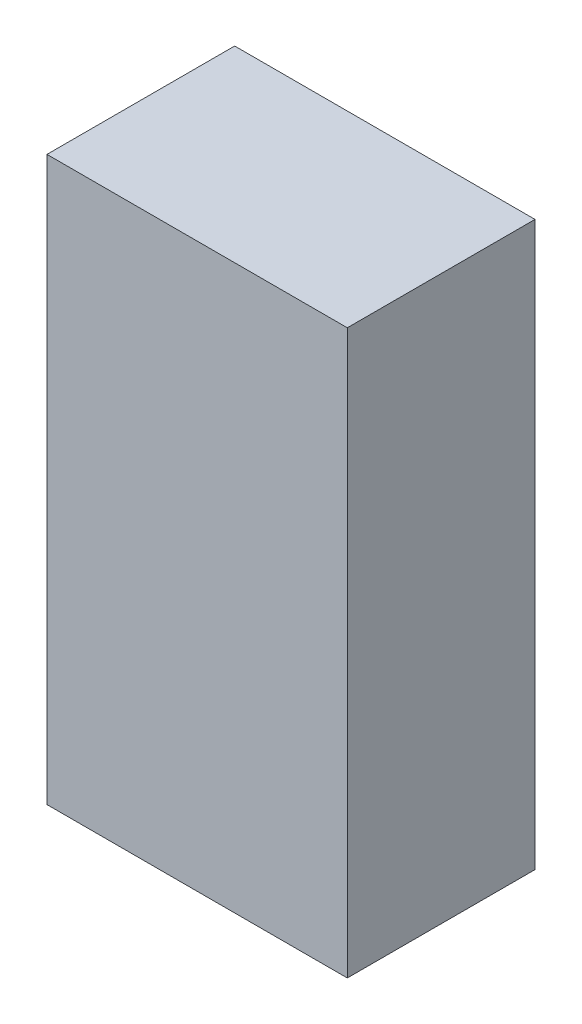
ISO-10303-21;
HEADER;
FILE_DESCRIPTION(('STEP AP214'),'2;1');
FILE_NAME('part.step','',(''),(''),'','','');
FILE_SCHEMA(('AUTOMOTIVE_DESIGN { 1 0 10303 214 1 1 1 1 }'));
ENDSEC;
DATA;
#1=APPLICATION_CONTEXT('core data for automotive mechanical design processes');
#2=APPLICATION_PROTOCOL_DEFINITION('international standard','automotive_design',2000,#1);
#3=PRODUCT_CONTEXT('',#1,'mechanical');
#4=PRODUCT('Part','Part','',(#3));
#5=PRODUCT_RELATED_PRODUCT_CATEGORY('part','',(#4));
#6=PRODUCT_DEFINITION_FORMATION('','',#4);
#7=PRODUCT_DEFINITION_CONTEXT('part definition',#1,'design');
#8=PRODUCT_DEFINITION('design','',#6,#7);
#9=PRODUCT_DEFINITION_SHAPE('','',#8);
#10=(LENGTH_UNIT() NAMED_UNIT(*) SI_UNIT(.MILLI.,.METRE.));
#11=(NAMED_UNIT(*) PLANE_ANGLE_UNIT() SI_UNIT($,.RADIAN.));
#12=(NAMED_UNIT(*) SI_UNIT($,.STERADIAN.) SOLID_ANGLE_UNIT());
#13=UNCERTAINTY_MEASURE_WITH_UNIT(LENGTH_MEASURE(1.E-05),#10,'distance_accuracy_value','');
#14=(GEOMETRIC_REPRESENTATION_CONTEXT(3) GLOBAL_UNCERTAINTY_ASSIGNED_CONTEXT((#13)) GLOBAL_UNIT_ASSIGNED_CONTEXT((#10,
#11,#12)) REPRESENTATION_CONTEXT('',''));
#15=CARTESIAN_POINT('',(0.,0.,0.));
#16=DIRECTION('',(0.,0.,1.));
#17=DIRECTION('',(1.,0.,0.));
#18=AXIS2_PLACEMENT_3D('',#15,#16,#17);
#19=CARTESIAN_POINT('',(4.,7.5,5.));
#20=DIRECTION('',(-1.,0.,0.));
#21=DIRECTION('',(0.,-1.,0.));
#22=AXIS2_PLACEMENT_3D('',#19,#20,#21);
#23=PLANE('',#22);
#24=DIRECTION('',(0.,1.,0.));
#25=VECTOR('',#24,1.);
#26=CARTESIAN_POINT('',(4.,7.5,0.));
#27=LINE('',#26,#25);
#28=CARTESIAN_POINT('',(4.,-7.5,0.));
#29=VERTEX_POINT('',#28);
#30=CARTESIAN_POINT('',(4.,7.5,0.));
#31=VERTEX_POINT('',#30);
#32=EDGE_CURVE('E96',#29,#31,#27,.T.);
#33=ORIENTED_EDGE('',*,*,#32,.T.);
#34=DIRECTION('',(0.,0.,-1.));
#35=VECTOR('',#34,1.);
#36=CARTESIAN_POINT('',(4.,7.5,5.));
#37=LINE('',#36,#35);
#38=CARTESIAN_POINT('',(4.,7.5,5.));
#39=VERTEX_POINT('',#38);
#40=EDGE_CURVE('E11',#39,#31,#37,.T.);
#41=ORIENTED_EDGE('',*,*,#40,.F.);
#42=DIRECTION('',(0.,1.,0.));
#43=VECTOR('',#42,1.);
#44=CARTESIAN_POINT('',(4.,7.5,5.));
#45=LINE('',#44,#43);
#46=CARTESIAN_POINT('',(4.,-7.5,5.));
#47=VERTEX_POINT('',#46);
#48=EDGE_CURVE('E84',#47,#39,#45,.T.);
#49=ORIENTED_EDGE('',*,*,#48,.F.);
#50=DIRECTION('',(0.,0.,-1.));
#51=VECTOR('',#50,1.);
#52=CARTESIAN_POINT('',(4.,-7.5,5.));
#53=LINE('',#52,#51);
#54=EDGE_CURVE('E92',#47,#29,#53,.T.);
#55=ORIENTED_EDGE('',*,*,#54,.T.);
#56=EDGE_LOOP('',(#33,#41,#49,#55));
#57=FACE_BOUND('',#56,.T.);
#58=ADVANCED_FACE('F33',(#57),#23,.F.);
#59=CARTESIAN_POINT('',(-4.,7.5,5.));
#60=DIRECTION('',(0.,-1.,0.));
#61=DIRECTION('',(0.,0.,-1.));
#62=AXIS2_PLACEMENT_3D('',#59,#60,#61);
#63=PLANE('',#62);
#64=DIRECTION('',(-1.,0.,0.));
#65=VECTOR('',#64,1.);
#66=CARTESIAN_POINT('',(-4.,7.5,0.));
#67=LINE('',#66,#65);
#68=CARTESIAN_POINT('',(-4.,7.5,0.));
#69=VERTEX_POINT('',#68);
#70=EDGE_CURVE('E88',#31,#69,#67,.T.);
#71=ORIENTED_EDGE('',*,*,#70,.T.);
#72=DIRECTION('',(0.,0.,-1.));
#73=VECTOR('',#72,1.);
#74=CARTESIAN_POINT('',(-4.,7.5,5.));
#75=LINE('',#74,#73);
#76=CARTESIAN_POINT('',(-4.,7.5,5.));
#77=VERTEX_POINT('',#76);
#78=EDGE_CURVE('E41',#77,#69,#75,.T.);
#79=ORIENTED_EDGE('',*,*,#78,.F.);
#80=DIRECTION('',(-1.,0.,0.));
#81=VECTOR('',#80,1.);
#82=CARTESIAN_POINT('',(-4.,7.5,5.));
#83=LINE('',#82,#81);
#84=EDGE_CURVE('E79',#39,#77,#83,.T.);
#85=ORIENTED_EDGE('',*,*,#84,.F.);
#86=ORIENTED_EDGE('',*,*,#40,.T.);
#87=EDGE_LOOP('',(#71,#79,#85,#86));
#88=FACE_BOUND('',#87,.T.);
#89=ADVANCED_FACE('F87',(#88),#63,.F.);
#90=CARTESIAN_POINT('',(-4.,7.5,5.));
#91=DIRECTION('',(1.,0.,0.));
#92=DIRECTION('',(0.,1.,0.));
#93=AXIS2_PLACEMENT_3D('',#90,#91,#92);
#94=PLANE('',#93);
#95=DIRECTION('',(0.,-1.,0.));
#96=VECTOR('',#95,1.);
#97=CARTESIAN_POINT('',(-4.,7.5,0.));
#98=LINE('',#97,#96);
#99=CARTESIAN_POINT('',(-4.,-7.5,0.));
#100=VERTEX_POINT('',#99);
#101=EDGE_CURVE('E66',#69,#100,#98,.T.);
#102=ORIENTED_EDGE('',*,*,#101,.T.);
#103=DIRECTION('',(0.,0.,-1.));
#104=VECTOR('',#103,1.);
#105=CARTESIAN_POINT('',(-4.,-7.5,5.));
#106=LINE('',#105,#104);
#107=CARTESIAN_POINT('',(-4.,-7.5,5.));
#108=VERTEX_POINT('',#107);
#109=EDGE_CURVE('E89',#108,#100,#106,.T.);
#110=ORIENTED_EDGE('',*,*,#109,.F.);
#111=DIRECTION('',(0.,-1.,0.));
#112=VECTOR('',#111,1.);
#113=CARTESIAN_POINT('',(-4.,7.5,5.));
#114=LINE('',#113,#112);
#115=EDGE_CURVE('E82',#77,#108,#114,.T.);
#116=ORIENTED_EDGE('',*,*,#115,.F.);
#117=ORIENTED_EDGE('',*,*,#78,.T.);
#118=EDGE_LOOP('',(#102,#110,#116,#117));
#119=FACE_BOUND('',#118,.T.);
#120=ADVANCED_FACE('F90',(#119),#94,.F.);
#121=CARTESIAN_POINT('',(-4.,-7.5,5.));
#122=DIRECTION('',(0.,1.,0.));
#123=DIRECTION('',(0.,0.,1.));
#124=AXIS2_PLACEMENT_3D('',#121,#122,#123);
#125=PLANE('',#124);
#126=DIRECTION('',(1.,0.,0.));
#127=VECTOR('',#126,1.);
#128=CARTESIAN_POINT('',(-4.,-7.5,0.));
#129=LINE('',#128,#127);
#130=EDGE_CURVE('E72',#100,#29,#129,.T.);
#131=ORIENTED_EDGE('',*,*,#130,.T.);
#132=ORIENTED_EDGE('',*,*,#54,.F.);
#133=DIRECTION('',(1.,0.,0.));
#134=VECTOR('',#133,1.);
#135=CARTESIAN_POINT('',(-4.,-7.5,5.));
#136=LINE('',#135,#134);
#137=EDGE_CURVE('E49',#108,#47,#136,.T.);
#138=ORIENTED_EDGE('',*,*,#137,.F.);
#139=ORIENTED_EDGE('',*,*,#109,.T.);
#140=EDGE_LOOP('',(#131,#132,#138,#139));
#141=FACE_BOUND('',#140,.T.);
#142=ADVANCED_FACE('F103',(#141),#125,.F.);
#143=CARTESIAN_POINT('',(0.,0.,5.));
#144=DIRECTION('',(0.,0.,1.));
#145=DIRECTION('',(1.,0.,0.));
#146=AXIS2_PLACEMENT_3D('',#143,#144,#145);
#147=PLANE('',#146);
#148=ORIENTED_EDGE('',*,*,#48,.T.);
#149=ORIENTED_EDGE('',*,*,#84,.T.);
#150=ORIENTED_EDGE('',*,*,#115,.T.);
#151=ORIENTED_EDGE('',*,*,#137,.T.);
#152=EDGE_LOOP('',(#148,#149,#150,#151));
#153=FACE_BOUND('',#152,.T.);
#154=ADVANCED_FACE('F80',(#153),#147,.T.);
#155=CARTESIAN_POINT('',(0.,0.,0.));
#156=DIRECTION('',(0.,0.,1.));
#157=DIRECTION('',(1.,0.,0.));
#158=AXIS2_PLACEMENT_3D('',#155,#156,#157);
#159=PLANE('',#158);
#160=ORIENTED_EDGE('',*,*,#32,.F.);
#161=ORIENTED_EDGE('',*,*,#130,.F.);
#162=ORIENTED_EDGE('',*,*,#101,.F.);
#163=ORIENTED_EDGE('',*,*,#70,.F.);
#164=EDGE_LOOP('',(#160,#161,#162,#163));
#165=FACE_BOUND('',#164,.T.);
#166=ADVANCED_FACE('F106',(#165),#159,.F.);
#167=CLOSED_SHELL('',(#58,#89,#120,#142,#154,#166));
#168=MANIFOLD_SOLID_BREP('B2',#167);
#169=ADVANCED_BREP_SHAPE_REPRESENTATION('',(#18,#168),#14);
#170=SHAPE_DEFINITION_REPRESENTATION(#9,#169);
ENDSEC;
END-ISO-10303-21;
